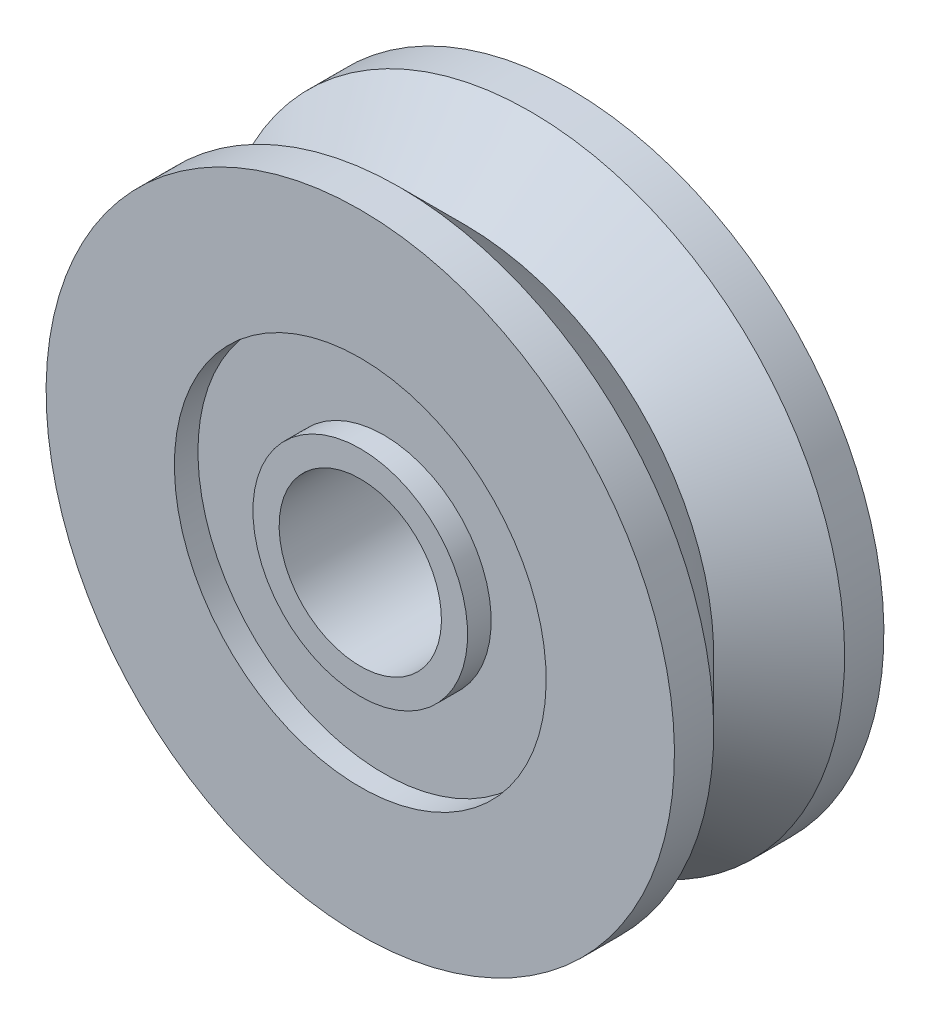
ISO-10303-21;
HEADER;
FILE_DESCRIPTION(('STEP AP214'),'2;1');
FILE_NAME('part.step','',(''),(''),'','','');
FILE_SCHEMA(('AUTOMOTIVE_DESIGN { 1 0 10303 214 1 1 1 1 }'));
ENDSEC;
DATA;
#1=APPLICATION_CONTEXT('core data for automotive mechanical design processes');
#2=APPLICATION_PROTOCOL_DEFINITION('international standard','automotive_design',2000,#1);
#3=PRODUCT_CONTEXT('',#1,'mechanical');
#4=PRODUCT('Part','Part','',(#3));
#5=PRODUCT_RELATED_PRODUCT_CATEGORY('part','',(#4));
#6=PRODUCT_DEFINITION_FORMATION('','',#4);
#7=PRODUCT_DEFINITION_CONTEXT('part definition',#1,'design');
#8=PRODUCT_DEFINITION('design','',#6,#7);
#9=PRODUCT_DEFINITION_SHAPE('','',#8);
#10=(LENGTH_UNIT() NAMED_UNIT(*) SI_UNIT(.MILLI.,.METRE.));
#11=(NAMED_UNIT(*) PLANE_ANGLE_UNIT() SI_UNIT($,.RADIAN.));
#12=(NAMED_UNIT(*) SI_UNIT($,.STERADIAN.) SOLID_ANGLE_UNIT());
#13=UNCERTAINTY_MEASURE_WITH_UNIT(LENGTH_MEASURE(1.E-05),#10,'distance_accuracy_value','');
#14=(GEOMETRIC_REPRESENTATION_CONTEXT(3) GLOBAL_UNCERTAINTY_ASSIGNED_CONTEXT((#13)) GLOBAL_UNIT_ASSIGNED_CONTEXT((#10,
#11,#12)) REPRESENTATION_CONTEXT('',''));
#15=CARTESIAN_POINT('',(0.,0.,0.));
#16=DIRECTION('',(0.,0.,1.));
#17=DIRECTION('',(1.,0.,0.));
#18=AXIS2_PLACEMENT_3D('',#15,#16,#17);
#19=CARTESIAN_POINT('',(0.,2.05000000000001,-1.55000000000001));
#20=DIRECTION('',(0.,0.,-1.));
#21=DIRECTION('',(0.,1.,0.));
#22=AXIS2_PLACEMENT_3D('',#19,#20,#21);
#23=PLANE('',#22);
#24=CARTESIAN_POINT('',(0.,0.,-1.55000000000001));
#25=DIRECTION('',(0.,0.,-1.));
#26=DIRECTION('',(0.,1.,0.));
#27=AXIS2_PLACEMENT_3D('',#24,#25,#26);
#28=CIRCLE('',#27,2.05000000000001);
#29=CARTESIAN_POINT('',(0.,2.05000000000001,-1.55000000000001));
#30=VERTEX_POINT('',#29);
#31=EDGE_CURVE('E17',#30,#30,#28,.T.);
#32=ORIENTED_EDGE('',*,*,#31,.F.);
#33=EDGE_LOOP('',(#32));
#34=FACE_BOUND('',#33,.T.);
#35=CARTESIAN_POINT('',(0.,0.,-1.55));
#36=DIRECTION('',(0.,0.,-1.));
#37=DIRECTION('',(0.,1.,0.));
#38=AXIS2_PLACEMENT_3D('',#35,#36,#37);
#39=CIRCLE('',#38,3.55000000000001);
#40=CARTESIAN_POINT('',(0.,3.55000000000001,-1.55000000000001));
#41=VERTEX_POINT('',#40);
#42=EDGE_CURVE('E57',#41,#41,#39,.T.);
#43=ORIENTED_EDGE('',*,*,#42,.T.);
#44=EDGE_LOOP('',(#43));
#45=FACE_BOUND('',#44,.T.);
#46=ADVANCED_FACE('F14',(#34,#45),#23,.T.);
#47=CARTESIAN_POINT('',(0.,0.,-1.775));
#48=DIRECTION('',(0.,0.,-1.));
#49=DIRECTION('',(0.,1.,0.));
#50=AXIS2_PLACEMENT_3D('',#47,#48,#49);
#51=CYLINDRICAL_SURFACE('',#50,2.05000000000001);
#52=CARTESIAN_POINT('',(0.,0.,-2.));
#53=DIRECTION('',(0.,0.,-1.));
#54=DIRECTION('',(0.,1.,0.));
#55=AXIS2_PLACEMENT_3D('',#52,#53,#54);
#56=CIRCLE('',#55,2.05000000000001);
#57=CARTESIAN_POINT('',(0.,2.05000000000001,-2.));
#58=VERTEX_POINT('',#57);
#59=EDGE_CURVE('E55',#58,#58,#56,.T.);
#60=ORIENTED_EDGE('',*,*,#59,.F.);
#61=EDGE_LOOP('',(#60));
#62=FACE_BOUND('',#61,.T.);
#63=ORIENTED_EDGE('',*,*,#31,.T.);
#64=EDGE_LOOP('',(#63));
#65=FACE_BOUND('',#64,.T.);
#66=ADVANCED_FACE('F64',(#62,#65),#51,.T.);
#67=CARTESIAN_POINT('',(0.,0.,-1.77499999999999));
#68=DIRECTION('',(0.,0.,-1.));
#69=DIRECTION('',(0.,1.,0.));
#70=AXIS2_PLACEMENT_3D('',#67,#68,#69);
#71=CYLINDRICAL_SURFACE('',#70,3.55000000000001);
#72=ORIENTED_EDGE('',*,*,#42,.F.);
#73=EDGE_LOOP('',(#72));
#74=FACE_BOUND('',#73,.T.);
#75=CARTESIAN_POINT('',(0.,0.,-1.99999999999998));
#76=DIRECTION('',(0.,0.,-1.));
#77=DIRECTION('',(0.,1.,0.));
#78=AXIS2_PLACEMENT_3D('',#75,#76,#77);
#79=CIRCLE('',#78,3.55000000000001);
#80=CARTESIAN_POINT('',(0.,3.55000000000001,-1.99999999999999));
#81=VERTEX_POINT('',#80);
#82=EDGE_CURVE('E52',#81,#81,#79,.F.);
#83=ORIENTED_EDGE('',*,*,#82,.F.);
#84=EDGE_LOOP('',(#83));
#85=FACE_BOUND('',#84,.T.);
#86=ADVANCED_FACE('F71',(#74,#85),#71,.F.);
#87=CARTESIAN_POINT('',(0.,1.55,-2.));
#88=DIRECTION('',(0.,0.,-1.));
#89=DIRECTION('',(0.,1.,0.));
#90=AXIS2_PLACEMENT_3D('',#87,#88,#89);
#91=PLANE('',#90);
#92=CARTESIAN_POINT('',(0.,0.,-2.));
#93=DIRECTION('',(0.,0.,-1.));
#94=DIRECTION('',(0.,1.,0.));
#95=AXIS2_PLACEMENT_3D('',#92,#93,#94);
#96=CIRCLE('',#95,1.55);
#97=CARTESIAN_POINT('',(0.,1.55,-2.));
#98=VERTEX_POINT('',#97);
#99=EDGE_CURVE('E49',#98,#98,#96,.F.);
#100=ORIENTED_EDGE('',*,*,#99,.T.);
#101=EDGE_LOOP('',(#100));
#102=FACE_BOUND('',#101,.T.);
#103=ORIENTED_EDGE('',*,*,#59,.T.);
#104=EDGE_LOOP('',(#103));
#105=FACE_BOUND('',#104,.T.);
#106=ADVANCED_FACE('F119',(#102,#105),#91,.T.);
#107=CARTESIAN_POINT('',(0.,3.55000000000001,-1.99999999999999));
#108=DIRECTION('',(0.,0.,-1.));
#109=DIRECTION('',(0.,1.,0.));
#110=AXIS2_PLACEMENT_3D('',#107,#108,#109);
#111=PLANE('',#110);
#112=ORIENTED_EDGE('',*,*,#82,.T.);
#113=EDGE_LOOP('',(#112));
#114=FACE_BOUND('',#113,.T.);
#115=CARTESIAN_POINT('',(0.,0.,-1.99999999999999));
#116=DIRECTION('',(0.,0.,-1.));
#117=DIRECTION('',(0.,1.,0.));
#118=AXIS2_PLACEMENT_3D('',#115,#116,#117);
#119=CIRCLE('',#118,5.99999999999999);
#120=CARTESIAN_POINT('',(0.,5.99999999999999,-2.));
#121=VERTEX_POINT('',#120);
#122=EDGE_CURVE('E46',#121,#121,#119,.F.);
#123=ORIENTED_EDGE('',*,*,#122,.F.);
#124=EDGE_LOOP('',(#123));
#125=FACE_BOUND('',#124,.T.);
#126=ADVANCED_FACE('F115',(#114,#125),#111,.T.);
#127=CARTESIAN_POINT('',(0.,0.,0.));
#128=DIRECTION('',(0.,0.,-1.));
#129=DIRECTION('',(0.,1.,0.));
#130=AXIS2_PLACEMENT_3D('',#127,#128,#129);
#131=CYLINDRICAL_SURFACE('',#130,1.55);
#132=CARTESIAN_POINT('',(0.,0.,2.));
#133=DIRECTION('',(0.,0.,-1.));
#134=DIRECTION('',(0.,1.,0.));
#135=AXIS2_PLACEMENT_3D('',#132,#133,#134);
#136=CIRCLE('',#135,1.55);
#137=CARTESIAN_POINT('',(0.,1.55,2.));
#138=VERTEX_POINT('',#137);
#139=EDGE_CURVE('E43',#138,#138,#136,.T.);
#140=ORIENTED_EDGE('',*,*,#139,.F.);
#141=EDGE_LOOP('',(#140));
#142=FACE_BOUND('',#141,.T.);
#143=ORIENTED_EDGE('',*,*,#99,.F.);
#144=EDGE_LOOP('',(#143));
#145=FACE_BOUND('',#144,.T.);
#146=ADVANCED_FACE('F111',(#142,#145),#131,.F.);
#147=CARTESIAN_POINT('',(0.,0.,-1.62499999999999));
#148=DIRECTION('',(0.,0.,-1.));
#149=DIRECTION('',(0.,1.,0.));
#150=AXIS2_PLACEMENT_3D('',#147,#148,#149);
#151=CYLINDRICAL_SURFACE('',#150,5.99999999999999);
#152=ORIENTED_EDGE('',*,*,#122,.T.);
#153=EDGE_LOOP('',(#152));
#154=FACE_BOUND('',#153,.T.);
#155=CARTESIAN_POINT('',(0.,0.,-1.25000000002727));
#156=DIRECTION('',(0.,0.,-1.));
#157=DIRECTION('',(0.,1.,0.));
#158=AXIS2_PLACEMENT_3D('',#155,#156,#157);
#159=CIRCLE('',#158,5.99999999997181);
#160=CARTESIAN_POINT('',(0.,5.9999999999718,-1.25000000002728));
#161=VERTEX_POINT('',#160);
#162=EDGE_CURVE('E42',#161,#161,#159,.F.);
#163=ORIENTED_EDGE('',*,*,#162,.F.);
#164=EDGE_LOOP('',(#163));
#165=FACE_BOUND('',#164,.T.);
#166=ADVANCED_FACE('F107',(#154,#165),#151,.T.);
#167=CARTESIAN_POINT('',(0.,2.05000000000001,1.99999999999999));
#168=DIRECTION('',(0.,0.,1.));
#169=DIRECTION('',(0.,-1.,0.));
#170=AXIS2_PLACEMENT_3D('',#167,#168,#169);
#171=PLANE('',#170);
#172=ORIENTED_EDGE('',*,*,#139,.T.);
#173=EDGE_LOOP('',(#172));
#174=FACE_BOUND('',#173,.T.);
#175=CARTESIAN_POINT('',(0.,0.,1.99999999999999));
#176=DIRECTION('',(0.,0.,-1.));
#177=DIRECTION('',(0.,1.,0.));
#178=AXIS2_PLACEMENT_3D('',#175,#176,#177);
#179=CIRCLE('',#178,2.05);
#180=CARTESIAN_POINT('',(0.,2.05,1.99999999999999));
#181=VERTEX_POINT('',#180);
#182=EDGE_CURVE('E39',#181,#181,#179,.T.);
#183=ORIENTED_EDGE('',*,*,#182,.F.);
#184=EDGE_LOOP('',(#183));
#185=FACE_BOUND('',#184,.T.);
#186=ADVANCED_FACE('F103',(#174,#185),#171,.T.);
#187=CARTESIAN_POINT('',(0.,0.,-1.25000000002727));
#188=DIRECTION('',(0.,0.,-1.));
#189=DIRECTION('',(0.,1.,0.));
#190=AXIS2_PLACEMENT_3D('',#187,#188,#189);
#191=CONICAL_SURFACE('',#190,5.99999999997181,0.78539816339745);
#192=ORIENTED_EDGE('',*,*,#162,.T.);
#193=EDGE_LOOP('',(#192));
#194=FACE_BOUND('',#193,.T.);
#195=CARTESIAN_POINT('',(0.,0.,0.));
#196=DIRECTION('',(0.,0.,1.));
#197=DIRECTION('',(0.,1.,0.));
#198=AXIS2_PLACEMENT_3D('',#195,#196,#197);
#199=CIRCLE('',#198,4.75000000000136);
#200=CARTESIAN_POINT('',(0.,4.75000000000136,0.));
#201=VERTEX_POINT('',#200);
#202=EDGE_CURVE('E38',#201,#201,#199,.T.);
#203=ORIENTED_EDGE('',*,*,#202,.F.);
#204=EDGE_LOOP('',(#203));
#205=FACE_BOUND('',#204,.T.);
#206=ADVANCED_FACE('F99',(#194,#205),#191,.T.);
#207=CARTESIAN_POINT('',(0.,0.,1.775));
#208=DIRECTION('',(0.,0.,-1.));
#209=DIRECTION('',(0.,1.,0.));
#210=AXIS2_PLACEMENT_3D('',#207,#208,#209);
#211=CYLINDRICAL_SURFACE('',#210,2.05);
#212=CARTESIAN_POINT('',(0.,0.,1.54999999999999));
#213=DIRECTION('',(0.,0.,-1.));
#214=DIRECTION('',(0.,1.,0.));
#215=AXIS2_PLACEMENT_3D('',#212,#213,#214);
#216=CIRCLE('',#215,2.05);
#217=CARTESIAN_POINT('',(0.,2.05,1.54999999999999));
#218=VERTEX_POINT('',#217);
#219=EDGE_CURVE('E35',#218,#218,#216,.T.);
#220=ORIENTED_EDGE('',*,*,#219,.F.);
#221=EDGE_LOOP('',(#220));
#222=FACE_BOUND('',#221,.T.);
#223=ORIENTED_EDGE('',*,*,#182,.T.);
#224=EDGE_LOOP('',(#223));
#225=FACE_BOUND('',#224,.T.);
#226=ADVANCED_FACE('F95',(#222,#225),#211,.T.);
#227=CARTESIAN_POINT('',(0.,0.,1.24999999997045));
#228=DIRECTION('',(0.,0.,1.));
#229=DIRECTION('',(0.,-1.,0.));
#230=AXIS2_PLACEMENT_3D('',#227,#228,#229);
#231=CONICAL_SURFACE('',#230,5.9999999999718,0.785398163397446);
#232=ORIENTED_EDGE('',*,*,#202,.T.);
#233=EDGE_LOOP('',(#232));
#234=FACE_BOUND('',#233,.T.);
#235=CARTESIAN_POINT('',(0.,0.,1.24999999999999));
#236=DIRECTION('',(0.,0.,-1.));
#237=DIRECTION('',(0.,1.,0.));
#238=AXIS2_PLACEMENT_3D('',#235,#236,#237);
#239=CIRCLE('',#238,6.);
#240=CARTESIAN_POINT('',(0.,6.,1.24999999999998));
#241=VERTEX_POINT('',#240);
#242=EDGE_CURVE('E34',#241,#241,#239,.F.);
#243=ORIENTED_EDGE('',*,*,#242,.F.);
#244=EDGE_LOOP('',(#243));
#245=FACE_BOUND('',#244,.T.);
#246=ADVANCED_FACE('F91',(#234,#245),#231,.T.);
#247=CARTESIAN_POINT('',(0.,3.55000000000001,1.54999999999999));
#248=DIRECTION('',(0.,0.,1.));
#249=DIRECTION('',(0.,-1.,0.));
#250=AXIS2_PLACEMENT_3D('',#247,#248,#249);
#251=PLANE('',#250);
#252=ORIENTED_EDGE('',*,*,#219,.T.);
#253=EDGE_LOOP('',(#252));
#254=FACE_BOUND('',#253,.T.);
#255=CARTESIAN_POINT('',(0.,0.,1.55));
#256=DIRECTION('',(0.,0.,-1.));
#257=DIRECTION('',(0.,1.,0.));
#258=AXIS2_PLACEMENT_3D('',#255,#256,#257);
#259=CIRCLE('',#258,3.55);
#260=CARTESIAN_POINT('',(0.,3.55,1.54999999999999));
#261=VERTEX_POINT('',#260);
#262=EDGE_CURVE('E26',#261,#261,#259,.F.);
#263=ORIENTED_EDGE('',*,*,#262,.T.);
#264=EDGE_LOOP('',(#263));
#265=FACE_BOUND('',#264,.T.);
#266=ADVANCED_FACE('F87',(#254,#265),#251,.T.);
#267=CARTESIAN_POINT('',(0.,0.,1.62499999999999));
#268=DIRECTION('',(0.,0.,-1.));
#269=DIRECTION('',(0.,1.,0.));
#270=AXIS2_PLACEMENT_3D('',#267,#268,#269);
#271=CYLINDRICAL_SURFACE('',#270,6.);
#272=ORIENTED_EDGE('',*,*,#242,.T.);
#273=EDGE_LOOP('',(#272));
#274=FACE_BOUND('',#273,.T.);
#275=CARTESIAN_POINT('',(0.,0.,1.99999999999999));
#276=DIRECTION('',(0.,0.,-1.));
#277=DIRECTION('',(0.,1.,0.));
#278=AXIS2_PLACEMENT_3D('',#275,#276,#277);
#279=CIRCLE('',#278,6.);
#280=CARTESIAN_POINT('',(0.,6.,1.99999999999998));
#281=VERTEX_POINT('',#280);
#282=EDGE_CURVE('E21',#281,#281,#279,.F.);
#283=ORIENTED_EDGE('',*,*,#282,.F.);
#284=EDGE_LOOP('',(#283));
#285=FACE_BOUND('',#284,.T.);
#286=ADVANCED_FACE('F80',(#274,#285),#271,.T.);
#287=CARTESIAN_POINT('',(0.,0.,1.775));
#288=DIRECTION('',(0.,0.,-1.));
#289=DIRECTION('',(0.,1.,0.));
#290=AXIS2_PLACEMENT_3D('',#287,#288,#289);
#291=CYLINDRICAL_SURFACE('',#290,3.55);
#292=CARTESIAN_POINT('',(0.,0.,2.));
#293=DIRECTION('',(0.,0.,-1.));
#294=DIRECTION('',(0.,1.,0.));
#295=AXIS2_PLACEMENT_3D('',#292,#293,#294);
#296=CIRCLE('',#295,3.55);
#297=CARTESIAN_POINT('',(0.,3.55,1.99999999999999));
#298=VERTEX_POINT('',#297);
#299=EDGE_CURVE('E9',#298,#298,#296,.T.);
#300=ORIENTED_EDGE('',*,*,#299,.F.);
#301=EDGE_LOOP('',(#300));
#302=FACE_BOUND('',#301,.T.);
#303=ORIENTED_EDGE('',*,*,#262,.F.);
#304=EDGE_LOOP('',(#303));
#305=FACE_BOUND('',#304,.T.);
#306=ADVANCED_FACE('F75',(#302,#305),#291,.F.);
#307=CARTESIAN_POINT('',(0.,6.,1.99999999999998));
#308=DIRECTION('',(0.,0.,1.));
#309=DIRECTION('',(0.,-1.,0.));
#310=AXIS2_PLACEMENT_3D('',#307,#308,#309);
#311=PLANE('',#310);
#312=ORIENTED_EDGE('',*,*,#299,.T.);
#313=EDGE_LOOP('',(#312));
#314=FACE_BOUND('',#313,.T.);
#315=ORIENTED_EDGE('',*,*,#282,.T.);
#316=EDGE_LOOP('',(#315));
#317=FACE_BOUND('',#316,.T.);
#318=ADVANCED_FACE('F73',(#314,#317),#311,.T.);
#319=CLOSED_SHELL('',(#46,#66,#86,#106,#126,#146,#166,#186,#206,#226,#246,#266,#286,#306,#318));
#320=MANIFOLD_SOLID_BREP('B1',#319);
#321=ADVANCED_BREP_SHAPE_REPRESENTATION('',(#18,#320),#14);
#322=SHAPE_DEFINITION_REPRESENTATION(#9,#321);
ENDSEC;
END-ISO-10303-21;
